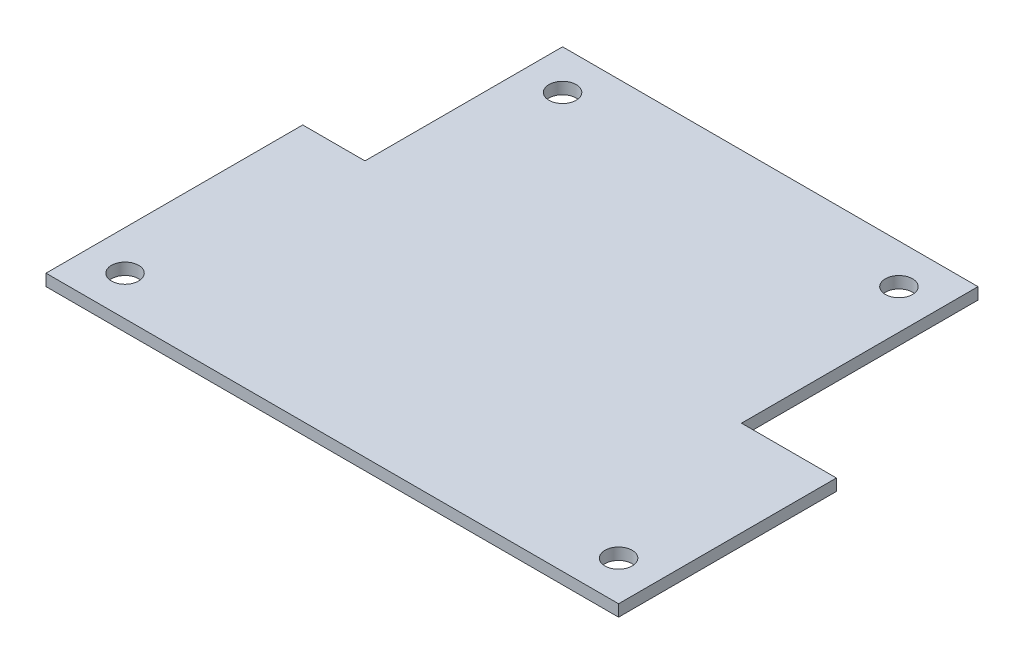
ISO-10303-21;
HEADER;
FILE_DESCRIPTION(('STEP AP214'),'2;1');
FILE_NAME('part.step','',(''),(''),'','','');
FILE_SCHEMA(('AUTOMOTIVE_DESIGN { 1 0 10303 214 1 1 1 1 }'));
ENDSEC;
DATA;
#1=APPLICATION_CONTEXT('core data for automotive mechanical design processes');
#2=APPLICATION_PROTOCOL_DEFINITION('international standard','automotive_design',2000,#1);
#3=PRODUCT_CONTEXT('',#1,'mechanical');
#4=PRODUCT('Part','Part','',(#3));
#5=PRODUCT_RELATED_PRODUCT_CATEGORY('part','',(#4));
#6=PRODUCT_DEFINITION_FORMATION('','',#4);
#7=PRODUCT_DEFINITION_CONTEXT('part definition',#1,'design');
#8=PRODUCT_DEFINITION('design','',#6,#7);
#9=PRODUCT_DEFINITION_SHAPE('','',#8);
#10=(LENGTH_UNIT() NAMED_UNIT(*) SI_UNIT(.MILLI.,.METRE.));
#11=(NAMED_UNIT(*) PLANE_ANGLE_UNIT() SI_UNIT($,.RADIAN.));
#12=(NAMED_UNIT(*) SI_UNIT($,.STERADIAN.) SOLID_ANGLE_UNIT());
#13=UNCERTAINTY_MEASURE_WITH_UNIT(LENGTH_MEASURE(1.E-05),#10,'distance_accuracy_value','');
#14=(GEOMETRIC_REPRESENTATION_CONTEXT(3) GLOBAL_UNCERTAINTY_ASSIGNED_CONTEXT((#13)) GLOBAL_UNIT_ASSIGNED_CONTEXT((#10,
#11,#12)) REPRESENTATION_CONTEXT('',''));
#15=CARTESIAN_POINT('',(0.,0.,0.));
#16=DIRECTION('',(0.,0.,1.));
#17=DIRECTION('',(1.,0.,0.));
#18=AXIS2_PLACEMENT_3D('',#15,#16,#17);
#19=CARTESIAN_POINT('',(0.,1.5,0.));
#20=DIRECTION('',(0.,1.,0.));
#21=DIRECTION('',(0.,0.,1.));
#22=AXIS2_PLACEMENT_3D('',#19,#20,#21);
#23=PLANE('',#22);
#24=CARTESIAN_POINT('',(13.08,1.5,-53.32));
#25=DIRECTION('',(0.,1.,0.));
#26=DIRECTION('',(0.,0.,1.));
#27=AXIS2_PLACEMENT_3D('',#24,#25,#26);
#28=CIRCLE('',#27,1.75);
#29=CARTESIAN_POINT('',(13.08,1.5,-51.57));
#30=VERTEX_POINT('',#29);
#31=EDGE_CURVE('E194',#30,#30,#28,.T.);
#32=ORIENTED_EDGE('',*,*,#31,.F.);
#33=EDGE_LOOP('',(#32));
#34=FACE_BOUND('',#33,.T.);
#35=CARTESIAN_POINT('',(5.08,1.5,-5.08));
#36=DIRECTION('',(0.,1.,0.));
#37=DIRECTION('',(0.,0.,1.));
#38=AXIS2_PLACEMENT_3D('',#35,#36,#37);
#39=CIRCLE('',#38,1.75);
#40=CARTESIAN_POINT('',(5.08,1.5,-3.33));
#41=VERTEX_POINT('',#40);
#42=EDGE_CURVE('E140',#41,#41,#39,.T.);
#43=ORIENTED_EDGE('',*,*,#42,.F.);
#44=EDGE_LOOP('',(#43));
#45=FACE_BOUND('',#44,.T.);
#46=DIRECTION('',(0.,0.,1.));
#47=VECTOR('',#46,1.);
#48=CARTESIAN_POINT('',(0.,1.5,-33.));
#49=LINE('',#48,#47);
#50=CARTESIAN_POINT('',(0.,1.5,-33.));
#51=VERTEX_POINT('',#50);
#52=CARTESIAN_POINT('',(0.,1.5,0.));
#53=VERTEX_POINT('',#52);
#54=EDGE_CURVE('E151',#51,#53,#49,.T.);
#55=ORIENTED_EDGE('',*,*,#54,.T.);
#56=DIRECTION('',(1.,0.,0.));
#57=VECTOR('',#56,1.);
#58=CARTESIAN_POINT('',(0.,1.5,0.));
#59=LINE('',#58,#57);
#60=CARTESIAN_POINT('',(73.6,1.5,0.));
#61=VERTEX_POINT('',#60);
#62=EDGE_CURVE('E99',#53,#61,#59,.T.);
#63=ORIENTED_EDGE('',*,*,#62,.T.);
#64=DIRECTION('',(0.,0.,-1.));
#65=VECTOR('',#64,1.);
#66=CARTESIAN_POINT('',(73.6,1.5,0.));
#67=LINE('',#66,#65);
#68=CARTESIAN_POINT('',(73.6,1.5,-28.));
#69=VERTEX_POINT('',#68);
#70=EDGE_CURVE('E166',#61,#69,#67,.T.);
#71=ORIENTED_EDGE('',*,*,#70,.T.);
#72=DIRECTION('',(-1.,0.,0.));
#73=VECTOR('',#72,1.);
#74=CARTESIAN_POINT('',(73.6,1.5,-28.));
#75=LINE('',#74,#73);
#76=CARTESIAN_POINT('',(61.4,1.5,-28.));
#77=VERTEX_POINT('',#76);
#78=EDGE_CURVE('E179',#69,#77,#75,.T.);
#79=ORIENTED_EDGE('',*,*,#78,.T.);
#80=DIRECTION('',(0.,0.,-1.));
#81=VECTOR('',#80,1.);
#82=CARTESIAN_POINT('',(61.4,1.5,-28.));
#83=LINE('',#82,#81);
#84=CARTESIAN_POINT('',(61.4,1.5,-58.4));
#85=VERTEX_POINT('',#84);
#86=EDGE_CURVE('E118',#77,#85,#83,.T.);
#87=ORIENTED_EDGE('',*,*,#86,.T.);
#88=DIRECTION('',(-1.,0.,0.));
#89=VECTOR('',#88,1.);
#90=CARTESIAN_POINT('',(61.4,1.5,-58.4));
#91=LINE('',#90,#89);
#92=CARTESIAN_POINT('',(8.,1.5,-58.4));
#93=VERTEX_POINT('',#92);
#94=EDGE_CURVE('E112',#85,#93,#91,.T.);
#95=ORIENTED_EDGE('',*,*,#94,.T.);
#96=DIRECTION('',(0.,0.,1.));
#97=VECTOR('',#96,1.);
#98=CARTESIAN_POINT('',(8.,1.5,-58.4));
#99=LINE('',#98,#97);
#100=CARTESIAN_POINT('',(8.,1.5,-33.));
#101=VERTEX_POINT('',#100);
#102=EDGE_CURVE('E116',#93,#101,#99,.T.);
#103=ORIENTED_EDGE('',*,*,#102,.T.);
#104=DIRECTION('',(-1.,0.,0.));
#105=VECTOR('',#104,1.);
#106=CARTESIAN_POINT('',(8.,1.5,-33.));
#107=LINE('',#106,#105);
#108=EDGE_CURVE('E56',#101,#51,#107,.T.);
#109=ORIENTED_EDGE('',*,*,#108,.T.);
#110=EDGE_LOOP('',(#55,#63,#71,#79,#87,#95,#103,#109));
#111=FACE_BOUND('',#110,.T.);
#112=CARTESIAN_POINT('',(68.52,1.5,-5.08));
#113=DIRECTION('',(0.,1.,0.));
#114=DIRECTION('',(0.,0.,1.));
#115=AXIS2_PLACEMENT_3D('',#112,#113,#114);
#116=CIRCLE('',#115,1.75);
#117=CARTESIAN_POINT('',(68.52,1.5,-3.33));
#118=VERTEX_POINT('',#117);
#119=EDGE_CURVE('E188',#118,#118,#116,.T.);
#120=ORIENTED_EDGE('',*,*,#119,.F.);
#121=EDGE_LOOP('',(#120));
#122=FACE_BOUND('',#121,.T.);
#123=CARTESIAN_POINT('',(56.32,1.5,-53.32));
#124=DIRECTION('',(0.,1.,0.));
#125=DIRECTION('',(0.,0.,1.));
#126=AXIS2_PLACEMENT_3D('',#123,#124,#125);
#127=CIRCLE('',#126,1.75);
#128=CARTESIAN_POINT('',(56.32,1.5,-51.57));
#129=VERTEX_POINT('',#128);
#130=EDGE_CURVE('E200',#129,#129,#127,.T.);
#131=ORIENTED_EDGE('',*,*,#130,.F.);
#132=EDGE_LOOP('',(#131));
#133=FACE_BOUND('',#132,.T.);
#134=ADVANCED_FACE('F39',(#34,#45,#111,#122,#133),#23,.T.);
#135=CARTESIAN_POINT('',(0.,0.,0.));
#136=DIRECTION('',(0.,1.,0.));
#137=DIRECTION('',(0.,0.,1.));
#138=AXIS2_PLACEMENT_3D('',#135,#136,#137);
#139=PLANE('',#138);
#140=DIRECTION('',(0.,0.,1.));
#141=VECTOR('',#140,1.);
#142=CARTESIAN_POINT('',(0.,0.,-33.));
#143=LINE('',#142,#141);
#144=CARTESIAN_POINT('',(0.,0.,-33.));
#145=VERTEX_POINT('',#144);
#146=CARTESIAN_POINT('',(0.,0.,0.));
#147=VERTEX_POINT('',#146);
#148=EDGE_CURVE('E136',#145,#147,#143,.T.);
#149=ORIENTED_EDGE('',*,*,#148,.F.);
#150=DIRECTION('',(-1.,0.,0.));
#151=VECTOR('',#150,1.);
#152=CARTESIAN_POINT('',(8.,0.,-33.));
#153=LINE('',#152,#151);
#154=CARTESIAN_POINT('',(8.,0.,-33.));
#155=VERTEX_POINT('',#154);
#156=EDGE_CURVE('E91',#155,#145,#153,.T.);
#157=ORIENTED_EDGE('',*,*,#156,.F.);
#158=DIRECTION('',(0.,0.,1.));
#159=VECTOR('',#158,1.);
#160=CARTESIAN_POINT('',(8.,0.,-58.4));
#161=LINE('',#160,#159);
#162=CARTESIAN_POINT('',(8.,0.,-58.4));
#163=VERTEX_POINT('',#162);
#164=EDGE_CURVE('E85',#163,#155,#161,.T.);
#165=ORIENTED_EDGE('',*,*,#164,.F.);
#166=DIRECTION('',(-1.,0.,0.));
#167=VECTOR('',#166,1.);
#168=CARTESIAN_POINT('',(61.4,0.,-58.4));
#169=LINE('',#168,#167);
#170=CARTESIAN_POINT('',(61.4,0.,-58.4));
#171=VERTEX_POINT('',#170);
#172=EDGE_CURVE('E126',#171,#163,#169,.T.);
#173=ORIENTED_EDGE('',*,*,#172,.F.);
#174=DIRECTION('',(0.,0.,-1.));
#175=VECTOR('',#174,1.);
#176=CARTESIAN_POINT('',(61.4,0.,-28.));
#177=LINE('',#176,#175);
#178=CARTESIAN_POINT('',(61.4,0.,-28.));
#179=VERTEX_POINT('',#178);
#180=EDGE_CURVE('E146',#179,#171,#177,.T.);
#181=ORIENTED_EDGE('',*,*,#180,.F.);
#182=DIRECTION('',(-1.,0.,0.));
#183=VECTOR('',#182,1.);
#184=CARTESIAN_POINT('',(73.6,0.,-28.));
#185=LINE('',#184,#183);
#186=CARTESIAN_POINT('',(73.6,0.,-28.));
#187=VERTEX_POINT('',#186);
#188=EDGE_CURVE('E144',#187,#179,#185,.T.);
#189=ORIENTED_EDGE('',*,*,#188,.F.);
#190=DIRECTION('',(0.,0.,-1.));
#191=VECTOR('',#190,1.);
#192=CARTESIAN_POINT('',(73.6,0.,0.));
#193=LINE('',#192,#191);
#194=CARTESIAN_POINT('',(73.6,0.,0.));
#195=VERTEX_POINT('',#194);
#196=EDGE_CURVE('E142',#195,#187,#193,.T.);
#197=ORIENTED_EDGE('',*,*,#196,.F.);
#198=DIRECTION('',(1.,0.,0.));
#199=VECTOR('',#198,1.);
#200=CARTESIAN_POINT('',(0.,0.,0.));
#201=LINE('',#200,#199);
#202=EDGE_CURVE('E139',#147,#195,#201,.T.);
#203=ORIENTED_EDGE('',*,*,#202,.F.);
#204=EDGE_LOOP('',(#149,#157,#165,#173,#181,#189,#197,#203));
#205=FACE_BOUND('',#204,.T.);
#206=CARTESIAN_POINT('',(5.08,0.,-5.08));
#207=DIRECTION('',(0.,1.,0.));
#208=DIRECTION('',(0.,0.,1.));
#209=AXIS2_PLACEMENT_3D('',#206,#207,#208);
#210=CIRCLE('',#209,1.75);
#211=CARTESIAN_POINT('',(5.08,0.,-3.33));
#212=VERTEX_POINT('',#211);
#213=EDGE_CURVE('E185',#212,#212,#210,.T.);
#214=ORIENTED_EDGE('',*,*,#213,.T.);
#215=EDGE_LOOP('',(#214));
#216=FACE_BOUND('',#215,.T.);
#217=CARTESIAN_POINT('',(68.52,0.,-5.08));
#218=DIRECTION('',(0.,1.,0.));
#219=DIRECTION('',(0.,0.,1.));
#220=AXIS2_PLACEMENT_3D('',#217,#218,#219);
#221=CIRCLE('',#220,1.75);
#222=CARTESIAN_POINT('',(68.52,0.,-3.33));
#223=VERTEX_POINT('',#222);
#224=EDGE_CURVE('E191',#223,#223,#221,.T.);
#225=ORIENTED_EDGE('',*,*,#224,.T.);
#226=EDGE_LOOP('',(#225));
#227=FACE_BOUND('',#226,.T.);
#228=CARTESIAN_POINT('',(13.08,0.,-53.32));
#229=DIRECTION('',(0.,1.,0.));
#230=DIRECTION('',(0.,0.,1.));
#231=AXIS2_PLACEMENT_3D('',#228,#229,#230);
#232=CIRCLE('',#231,1.75);
#233=CARTESIAN_POINT('',(13.08,0.,-51.57));
#234=VERTEX_POINT('',#233);
#235=EDGE_CURVE('E197',#234,#234,#232,.T.);
#236=ORIENTED_EDGE('',*,*,#235,.T.);
#237=EDGE_LOOP('',(#236));
#238=FACE_BOUND('',#237,.T.);
#239=CARTESIAN_POINT('',(56.32,0.,-53.32));
#240=DIRECTION('',(0.,1.,0.));
#241=DIRECTION('',(0.,0.,1.));
#242=AXIS2_PLACEMENT_3D('',#239,#240,#241);
#243=CIRCLE('',#242,1.75);
#244=CARTESIAN_POINT('',(56.32,0.,-51.57));
#245=VERTEX_POINT('',#244);
#246=EDGE_CURVE('E203',#245,#245,#243,.T.);
#247=ORIENTED_EDGE('',*,*,#246,.T.);
#248=EDGE_LOOP('',(#247));
#249=FACE_BOUND('',#248,.T.);
#250=ADVANCED_FACE('F170',(#205,#216,#227,#238,#249),#139,.F.);
#251=CARTESIAN_POINT('',(0.,1.5,-33.));
#252=DIRECTION('',(1.,0.,0.));
#253=DIRECTION('',(0.,0.,-1.));
#254=AXIS2_PLACEMENT_3D('',#251,#252,#253);
#255=PLANE('',#254);
#256=ORIENTED_EDGE('',*,*,#148,.T.);
#257=DIRECTION('',(0.,-1.,0.));
#258=VECTOR('',#257,1.);
#259=CARTESIAN_POINT('',(0.,1.5,0.));
#260=LINE('',#259,#258);
#261=EDGE_CURVE('E11',#53,#147,#260,.T.);
#262=ORIENTED_EDGE('',*,*,#261,.F.);
#263=ORIENTED_EDGE('',*,*,#54,.F.);
#264=DIRECTION('',(0.,-1.,0.));
#265=VECTOR('',#264,1.);
#266=CARTESIAN_POINT('',(0.,1.5,-33.));
#267=LINE('',#266,#265);
#268=EDGE_CURVE('E132',#51,#145,#267,.T.);
#269=ORIENTED_EDGE('',*,*,#268,.T.);
#270=EDGE_LOOP('',(#256,#262,#263,#269));
#271=FACE_BOUND('',#270,.T.);
#272=ADVANCED_FACE('F41',(#271),#255,.F.);
#273=CARTESIAN_POINT('',(0.,1.5,0.));
#274=DIRECTION('',(0.,0.,-1.));
#275=DIRECTION('',(-1.,0.,0.));
#276=AXIS2_PLACEMENT_3D('',#273,#274,#275);
#277=PLANE('',#276);
#278=ORIENTED_EDGE('',*,*,#202,.T.);
#279=DIRECTION('',(0.,-1.,0.));
#280=VECTOR('',#279,1.);
#281=CARTESIAN_POINT('',(73.6,1.5,0.));
#282=LINE('',#281,#280);
#283=EDGE_CURVE('E48',#61,#195,#282,.T.);
#284=ORIENTED_EDGE('',*,*,#283,.F.);
#285=ORIENTED_EDGE('',*,*,#62,.F.);
#286=ORIENTED_EDGE('',*,*,#261,.T.);
#287=EDGE_LOOP('',(#278,#284,#285,#286));
#288=FACE_BOUND('',#287,.T.);
#289=ADVANCED_FACE('F237',(#288),#277,.F.);
#290=CARTESIAN_POINT('',(73.6,1.5,0.));
#291=DIRECTION('',(-1.,0.,0.));
#292=DIRECTION('',(0.,0.,1.));
#293=AXIS2_PLACEMENT_3D('',#290,#291,#292);
#294=PLANE('',#293);
#295=ORIENTED_EDGE('',*,*,#196,.T.);
#296=DIRECTION('',(0.,-1.,0.));
#297=VECTOR('',#296,1.);
#298=CARTESIAN_POINT('',(73.6,1.5,-28.));
#299=LINE('',#298,#297);
#300=EDGE_CURVE('E158',#69,#187,#299,.T.);
#301=ORIENTED_EDGE('',*,*,#300,.F.);
#302=ORIENTED_EDGE('',*,*,#70,.F.);
#303=ORIENTED_EDGE('',*,*,#283,.T.);
#304=EDGE_LOOP('',(#295,#301,#302,#303));
#305=FACE_BOUND('',#304,.T.);
#306=ADVANCED_FACE('F164',(#305),#294,.F.);
#307=CARTESIAN_POINT('',(73.6,1.5,-28.));
#308=DIRECTION('',(0.,0.,1.));
#309=DIRECTION('',(1.,0.,0.));
#310=AXIS2_PLACEMENT_3D('',#307,#308,#309);
#311=PLANE('',#310);
#312=ORIENTED_EDGE('',*,*,#188,.T.);
#313=DIRECTION('',(0.,-1.,0.));
#314=VECTOR('',#313,1.);
#315=CARTESIAN_POINT('',(61.4,1.5,-28.));
#316=LINE('',#315,#314);
#317=EDGE_CURVE('E155',#77,#179,#316,.T.);
#318=ORIENTED_EDGE('',*,*,#317,.F.);
#319=ORIENTED_EDGE('',*,*,#78,.F.);
#320=ORIENTED_EDGE('',*,*,#300,.T.);
#321=EDGE_LOOP('',(#312,#318,#319,#320));
#322=FACE_BOUND('',#321,.T.);
#323=ADVANCED_FACE('F175',(#322),#311,.F.);
#324=CARTESIAN_POINT('',(61.4,1.5,-28.));
#325=DIRECTION('',(-1.,0.,0.));
#326=DIRECTION('',(0.,0.,1.));
#327=AXIS2_PLACEMENT_3D('',#324,#325,#326);
#328=PLANE('',#327);
#329=ORIENTED_EDGE('',*,*,#180,.T.);
#330=DIRECTION('',(0.,-1.,0.));
#331=VECTOR('',#330,1.);
#332=CARTESIAN_POINT('',(61.4,1.5,-58.4));
#333=LINE('',#332,#331);
#334=EDGE_CURVE('E127',#85,#171,#333,.T.);
#335=ORIENTED_EDGE('',*,*,#334,.F.);
#336=ORIENTED_EDGE('',*,*,#86,.F.);
#337=ORIENTED_EDGE('',*,*,#317,.T.);
#338=EDGE_LOOP('',(#329,#335,#336,#337));
#339=FACE_BOUND('',#338,.T.);
#340=ADVANCED_FACE('F178',(#339),#328,.F.);
#341=CARTESIAN_POINT('',(61.4,1.5,-58.4));
#342=DIRECTION('',(0.,0.,1.));
#343=DIRECTION('',(1.,0.,0.));
#344=AXIS2_PLACEMENT_3D('',#341,#342,#343);
#345=PLANE('',#344);
#346=ORIENTED_EDGE('',*,*,#172,.T.);
#347=DIRECTION('',(0.,-1.,0.));
#348=VECTOR('',#347,1.);
#349=CARTESIAN_POINT('',(8.,1.5,-58.4));
#350=LINE('',#349,#348);
#351=EDGE_CURVE('E123',#93,#163,#350,.T.);
#352=ORIENTED_EDGE('',*,*,#351,.F.);
#353=ORIENTED_EDGE('',*,*,#94,.F.);
#354=ORIENTED_EDGE('',*,*,#334,.T.);
#355=EDGE_LOOP('',(#346,#352,#353,#354));
#356=FACE_BOUND('',#355,.T.);
#357=ADVANCED_FACE('F124',(#356),#345,.F.);
#358=CARTESIAN_POINT('',(8.,1.5,-58.4));
#359=DIRECTION('',(1.,0.,0.));
#360=DIRECTION('',(0.,0.,-1.));
#361=AXIS2_PLACEMENT_3D('',#358,#359,#360);
#362=PLANE('',#361);
#363=ORIENTED_EDGE('',*,*,#164,.T.);
#364=DIRECTION('',(0.,-1.,0.));
#365=VECTOR('',#364,1.);
#366=CARTESIAN_POINT('',(8.,1.5,-33.));
#367=LINE('',#366,#365);
#368=EDGE_CURVE('E128',#101,#155,#367,.T.);
#369=ORIENTED_EDGE('',*,*,#368,.F.);
#370=ORIENTED_EDGE('',*,*,#102,.F.);
#371=ORIENTED_EDGE('',*,*,#351,.T.);
#372=EDGE_LOOP('',(#363,#369,#370,#371));
#373=FACE_BOUND('',#372,.T.);
#374=ADVANCED_FACE('F130',(#373),#362,.F.);
#375=CARTESIAN_POINT('',(8.,1.5,-33.));
#376=DIRECTION('',(0.,0.,1.));
#377=DIRECTION('',(1.,0.,0.));
#378=AXIS2_PLACEMENT_3D('',#375,#376,#377);
#379=PLANE('',#378);
#380=ORIENTED_EDGE('',*,*,#156,.T.);
#381=ORIENTED_EDGE('',*,*,#268,.F.);
#382=ORIENTED_EDGE('',*,*,#108,.F.);
#383=ORIENTED_EDGE('',*,*,#368,.T.);
#384=EDGE_LOOP('',(#380,#381,#382,#383));
#385=FACE_BOUND('',#384,.T.);
#386=ADVANCED_FACE('F225',(#385),#379,.F.);
#387=CARTESIAN_POINT('',(5.08,1.5,-5.08));
#388=DIRECTION('',(0.,-1.,0.));
#389=DIRECTION('',(0.,0.,-1.));
#390=AXIS2_PLACEMENT_3D('',#387,#388,#389);
#391=CYLINDRICAL_SURFACE('',#390,1.75);
#392=ORIENTED_EDGE('',*,*,#42,.T.);
#393=EDGE_LOOP('',(#392));
#394=FACE_BOUND('',#393,.T.);
#395=ORIENTED_EDGE('',*,*,#213,.F.);
#396=EDGE_LOOP('',(#395));
#397=FACE_BOUND('',#396,.T.);
#398=ADVANCED_FACE('F222',(#394,#397),#391,.F.);
#399=CARTESIAN_POINT('',(68.52,1.5,-5.08));
#400=DIRECTION('',(0.,-1.,0.));
#401=DIRECTION('',(0.,0.,-1.));
#402=AXIS2_PLACEMENT_3D('',#399,#400,#401);
#403=CYLINDRICAL_SURFACE('',#402,1.75);
#404=ORIENTED_EDGE('',*,*,#119,.T.);
#405=EDGE_LOOP('',(#404));
#406=FACE_BOUND('',#405,.T.);
#407=ORIENTED_EDGE('',*,*,#224,.F.);
#408=EDGE_LOOP('',(#407));
#409=FACE_BOUND('',#408,.T.);
#410=ADVANCED_FACE('F313',(#406,#409),#403,.F.);
#411=CARTESIAN_POINT('',(13.08,1.5,-53.32));
#412=DIRECTION('',(0.,-1.,0.));
#413=DIRECTION('',(0.,0.,-1.));
#414=AXIS2_PLACEMENT_3D('',#411,#412,#413);
#415=CYLINDRICAL_SURFACE('',#414,1.75);
#416=ORIENTED_EDGE('',*,*,#31,.T.);
#417=EDGE_LOOP('',(#416));
#418=FACE_BOUND('',#417,.T.);
#419=ORIENTED_EDGE('',*,*,#235,.F.);
#420=EDGE_LOOP('',(#419));
#421=FACE_BOUND('',#420,.T.);
#422=ADVANCED_FACE('F322',(#418,#421),#415,.F.);
#423=CARTESIAN_POINT('',(56.32,1.5,-53.32));
#424=DIRECTION('',(0.,-1.,0.));
#425=DIRECTION('',(0.,0.,-1.));
#426=AXIS2_PLACEMENT_3D('',#423,#424,#425);
#427=CYLINDRICAL_SURFACE('',#426,1.75);
#428=ORIENTED_EDGE('',*,*,#130,.T.);
#429=EDGE_LOOP('',(#428));
#430=FACE_BOUND('',#429,.T.);
#431=ORIENTED_EDGE('',*,*,#246,.F.);
#432=EDGE_LOOP('',(#431));
#433=FACE_BOUND('',#432,.T.);
#434=ADVANCED_FACE('F209',(#430,#433),#427,.F.);
#435=CLOSED_SHELL('',(#134,#250,#272,#289,#306,#323,#340,#357,#374,#386,#398,#410,#422,#434));
#436=MANIFOLD_SOLID_BREP('B2',#435);
#437=ADVANCED_BREP_SHAPE_REPRESENTATION('',(#18,#436),#14);
#438=SHAPE_DEFINITION_REPRESENTATION(#9,#437);
ENDSEC;
END-ISO-10303-21;
